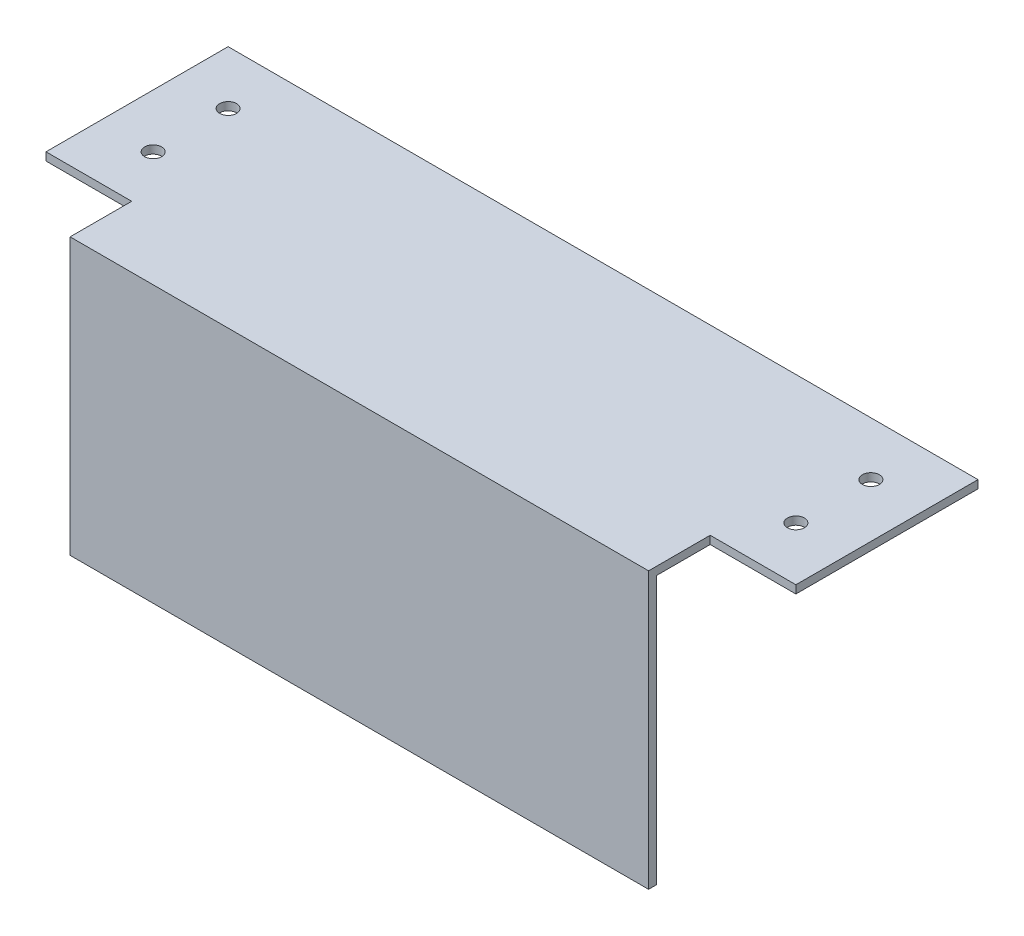
ISO-10303-21;
HEADER;
FILE_DESCRIPTION(('STEP AP214'),'2;1');
FILE_NAME('part.step','',(''),(''),'','','');
FILE_SCHEMA(('AUTOMOTIVE_DESIGN { 1 0 10303 214 1 1 1 1 }'));
ENDSEC;
DATA;
#1=APPLICATION_CONTEXT('core data for automotive mechanical design processes');
#2=APPLICATION_PROTOCOL_DEFINITION('international standard','automotive_design',2000,#1);
#3=PRODUCT_CONTEXT('',#1,'mechanical');
#4=PRODUCT('Part','Part','',(#3));
#5=PRODUCT_RELATED_PRODUCT_CATEGORY('part','',(#4));
#6=PRODUCT_DEFINITION_FORMATION('','',#4);
#7=PRODUCT_DEFINITION_CONTEXT('part definition',#1,'design');
#8=PRODUCT_DEFINITION('design','',#6,#7);
#9=PRODUCT_DEFINITION_SHAPE('','',#8);
#10=(LENGTH_UNIT() NAMED_UNIT(*) SI_UNIT(.MILLI.,.METRE.));
#11=(NAMED_UNIT(*) PLANE_ANGLE_UNIT() SI_UNIT($,.RADIAN.));
#12=(NAMED_UNIT(*) SI_UNIT($,.STERADIAN.) SOLID_ANGLE_UNIT());
#13=UNCERTAINTY_MEASURE_WITH_UNIT(LENGTH_MEASURE(1.E-05),#10,'distance_accuracy_value','');
#14=(GEOMETRIC_REPRESENTATION_CONTEXT(3) GLOBAL_UNCERTAINTY_ASSIGNED_CONTEXT((#13)) GLOBAL_UNIT_ASSIGNED_CONTEXT((#10,
#11,#12)) REPRESENTATION_CONTEXT('',''));
#15=CARTESIAN_POINT('',(0.,0.,0.));
#16=DIRECTION('',(0.,0.,1.));
#17=DIRECTION('',(1.,0.,0.));
#18=AXIS2_PLACEMENT_3D('',#15,#16,#17);
#19=CARTESIAN_POINT('',(0.,1.5,0.));
#20=DIRECTION('',(0.,-1.,0.));
#21=DIRECTION('',(0.,0.,-1.));
#22=AXIS2_PLACEMENT_3D('',#19,#20,#21);
#23=PLANE('',#22);
#24=DIRECTION('',(0.,0.,-1.));
#25=VECTOR('',#24,1.);
#26=CARTESIAN_POINT('',(84.4219002470459,1.5,-26.3714951285088));
#27=LINE('',#26,#25);
#28=CARTESIAN_POINT('',(84.4219002470459,1.5,-14.8714951285087));
#29=VERTEX_POINT('',#28);
#30=CARTESIAN_POINT('',(84.4219002470459,1.5,-26.3714951285088));
#31=VERTEX_POINT('',#30);
#32=EDGE_CURVE('E145',#29,#31,#27,.T.);
#33=ORIENTED_EDGE('',*,*,#32,.T.);
#34=DIRECTION('',(1.,0.,0.));
#35=VECTOR('',#34,1.);
#36=CARTESIAN_POINT('',(100.421900247046,1.5,-26.3714951285088));
#37=LINE('',#36,#35);
#38=CARTESIAN_POINT('',(100.421900247046,1.5,-26.3714951285088));
#39=VERTEX_POINT('',#38);
#40=EDGE_CURVE('E92',#31,#39,#37,.T.);
#41=ORIENTED_EDGE('',*,*,#40,.T.);
#42=DIRECTION('',(0.,0.,-1.));
#43=VECTOR('',#42,1.);
#44=CARTESIAN_POINT('',(100.421900247046,1.5,-60.371495128509));
#45=LINE('',#44,#43);
#46=CARTESIAN_POINT('',(100.421900247046,1.5,-60.371495128509));
#47=VERTEX_POINT('',#46);
#48=EDGE_CURVE('E161',#39,#47,#45,.T.);
#49=ORIENTED_EDGE('',*,*,#48,.T.);
#50=DIRECTION('',(-1.,0.,0.));
#51=VECTOR('',#50,1.);
#52=CARTESIAN_POINT('',(-39.578099752955,1.5,-60.371495128509));
#53=LINE('',#52,#51);
#54=CARTESIAN_POINT('',(-39.578099752955,1.5,-60.371495128509));
#55=VERTEX_POINT('',#54);
#56=EDGE_CURVE('E173',#47,#55,#53,.T.);
#57=ORIENTED_EDGE('',*,*,#56,.T.);
#58=DIRECTION('',(0.,0.,1.));
#59=VECTOR('',#58,1.);
#60=CARTESIAN_POINT('',(-39.578099752955,1.5,-26.3714951285087));
#61=LINE('',#60,#59);
#62=CARTESIAN_POINT('',(-39.578099752955,1.5,-26.3714951285087));
#63=VERTEX_POINT('',#62);
#64=EDGE_CURVE('E114',#55,#63,#61,.T.);
#65=ORIENTED_EDGE('',*,*,#64,.T.);
#66=DIRECTION('',(1.,0.,0.));
#67=VECTOR('',#66,1.);
#68=CARTESIAN_POINT('',(-39.578099752955,1.5,-26.3714951285087));
#69=LINE('',#68,#67);
#70=CARTESIAN_POINT('',(-23.578099752955,1.5,-26.3714951285087));
#71=VERTEX_POINT('',#70);
#72=EDGE_CURVE('E108',#63,#71,#69,.T.);
#73=ORIENTED_EDGE('',*,*,#72,.T.);
#74=DIRECTION('',(0.,0.,1.));
#75=VECTOR('',#74,1.);
#76=CARTESIAN_POINT('',(-23.578099752955,1.5,-26.3714951285087));
#77=LINE('',#76,#75);
#78=CARTESIAN_POINT('',(-23.578099752955,1.5,-14.8714951285087));
#79=VERTEX_POINT('',#78);
#80=EDGE_CURVE('E111',#71,#79,#77,.T.);
#81=ORIENTED_EDGE('',*,*,#80,.T.);
#82=DIRECTION('',(1.,0.,0.));
#83=VECTOR('',#82,1.);
#84=CARTESIAN_POINT('',(84.4219002470459,1.5,-14.8714951285087));
#85=LINE('',#84,#83);
#86=EDGE_CURVE('E56',#79,#29,#85,.T.);
#87=ORIENTED_EDGE('',*,*,#86,.T.);
#88=EDGE_LOOP('',(#33,#41,#49,#57,#65,#73,#81,#87));
#89=FACE_BOUND('',#88,.T.);
#90=CARTESIAN_POINT('',(90.4219002470459,1.5,-36.371495128509));
#91=DIRECTION('',(0.,1.,0.));
#92=DIRECTION('',(0.,0.,1.));
#93=AXIS2_PLACEMENT_3D('',#90,#91,#92);
#94=CIRCLE('',#93,1.5875);
#95=CARTESIAN_POINT('',(90.4219002470459,1.5,-34.783995128509));
#96=VERTEX_POINT('',#95);
#97=EDGE_CURVE('E134',#96,#96,#94,.T.);
#98=ORIENTED_EDGE('',*,*,#97,.F.);
#99=EDGE_LOOP('',(#98));
#100=FACE_BOUND('',#99,.T.);
#101=CARTESIAN_POINT('',(-29.578099752955,1.5,-36.371495128509));
#102=DIRECTION('',(0.,1.,0.));
#103=DIRECTION('',(0.,0.,1.));
#104=AXIS2_PLACEMENT_3D('',#101,#102,#103);
#105=CIRCLE('',#104,1.5875);
#106=CARTESIAN_POINT('',(-29.578099752955,1.5,-34.783995128509));
#107=VERTEX_POINT('',#106);
#108=EDGE_CURVE('E182',#107,#107,#105,.T.);
#109=ORIENTED_EDGE('',*,*,#108,.F.);
#110=EDGE_LOOP('',(#109));
#111=FACE_BOUND('',#110,.T.);
#112=CARTESIAN_POINT('',(90.4219002470459,1.5,-50.371495128509));
#113=DIRECTION('',(0.,1.,0.));
#114=DIRECTION('',(0.,0.,1.));
#115=AXIS2_PLACEMENT_3D('',#112,#113,#114);
#116=CIRCLE('',#115,1.5875);
#117=CARTESIAN_POINT('',(90.4219002470459,1.5,-48.783995128509));
#118=VERTEX_POINT('',#117);
#119=EDGE_CURVE('E188',#118,#118,#116,.T.);
#120=ORIENTED_EDGE('',*,*,#119,.F.);
#121=EDGE_LOOP('',(#120));
#122=FACE_BOUND('',#121,.T.);
#123=CARTESIAN_POINT('',(-29.578099752955,1.5,-50.371495128509));
#124=DIRECTION('',(0.,1.,0.));
#125=DIRECTION('',(0.,0.,1.));
#126=AXIS2_PLACEMENT_3D('',#123,#124,#125);
#127=CIRCLE('',#126,1.5875);
#128=CARTESIAN_POINT('',(-29.578099752955,1.5,-48.783995128509));
#129=VERTEX_POINT('',#128);
#130=EDGE_CURVE('E194',#129,#129,#127,.T.);
#131=ORIENTED_EDGE('',*,*,#130,.F.);
#132=EDGE_LOOP('',(#131));
#133=FACE_BOUND('',#132,.T.);
#134=ADVANCED_FACE('F32',(#89,#100,#111,#122,#133),#23,.F.);
#135=CARTESIAN_POINT('',(0.,0.,0.));
#136=DIRECTION('',(0.,-1.,0.));
#137=DIRECTION('',(0.,0.,-1.));
#138=AXIS2_PLACEMENT_3D('',#135,#136,#137);
#139=PLANE('',#138);
#140=DIRECTION('',(1.,0.,0.));
#141=VECTOR('',#140,1.);
#142=CARTESIAN_POINT('',(84.4219002470459,0.,-16.3714951285087));
#143=LINE('',#142,#141);
#144=CARTESIAN_POINT('',(-23.578099752955,0.,-16.3714951285087));
#145=VERTEX_POINT('',#144);
#146=CARTESIAN_POINT('',(84.4219002470459,0.,-16.3714951285087));
#147=VERTEX_POINT('',#146);
#148=EDGE_CURVE('E47',#145,#147,#143,.T.);
#149=ORIENTED_EDGE('',*,*,#148,.F.);
#150=DIRECTION('',(0.,0.,1.));
#151=VECTOR('',#150,1.);
#152=CARTESIAN_POINT('',(-23.578099752955,0.,-26.3714951285087));
#153=LINE('',#152,#151);
#154=CARTESIAN_POINT('',(-23.578099752955,0.,-26.3714951285087));
#155=VERTEX_POINT('',#154);
#156=EDGE_CURVE('E143',#155,#145,#153,.T.);
#157=ORIENTED_EDGE('',*,*,#156,.F.);
#158=DIRECTION('',(1.,0.,0.));
#159=VECTOR('',#158,1.);
#160=CARTESIAN_POINT('',(-39.578099752955,0.,-26.3714951285087));
#161=LINE('',#160,#159);
#162=CARTESIAN_POINT('',(-39.578099752955,0.,-26.3714951285087));
#163=VERTEX_POINT('',#162);
#164=EDGE_CURVE('E84',#163,#155,#161,.T.);
#165=ORIENTED_EDGE('',*,*,#164,.F.);
#166=DIRECTION('',(0.,0.,1.));
#167=VECTOR('',#166,1.);
#168=CARTESIAN_POINT('',(-39.578099752955,0.,-26.3714951285087));
#169=LINE('',#168,#167);
#170=CARTESIAN_POINT('',(-39.578099752955,0.,-60.371495128509));
#171=VERTEX_POINT('',#170);
#172=EDGE_CURVE('E140',#171,#163,#169,.T.);
#173=ORIENTED_EDGE('',*,*,#172,.F.);
#174=DIRECTION('',(-1.,0.,0.));
#175=VECTOR('',#174,1.);
#176=CARTESIAN_POINT('',(-39.578099752955,0.,-60.371495128509));
#177=LINE('',#176,#175);
#178=CARTESIAN_POINT('',(100.421900247046,0.,-60.371495128509));
#179=VERTEX_POINT('',#178);
#180=EDGE_CURVE('E138',#179,#171,#177,.T.);
#181=ORIENTED_EDGE('',*,*,#180,.F.);
#182=DIRECTION('',(0.,0.,-1.));
#183=VECTOR('',#182,1.);
#184=CARTESIAN_POINT('',(100.421900247046,0.,-60.371495128509));
#185=LINE('',#184,#183);
#186=CARTESIAN_POINT('',(100.421900247046,0.,-26.3714951285088));
#187=VERTEX_POINT('',#186);
#188=EDGE_CURVE('E136',#187,#179,#185,.T.);
#189=ORIENTED_EDGE('',*,*,#188,.F.);
#190=DIRECTION('',(1.,0.,0.));
#191=VECTOR('',#190,1.);
#192=CARTESIAN_POINT('',(100.421900247046,0.,-26.3714951285088));
#193=LINE('',#192,#191);
#194=CARTESIAN_POINT('',(84.4219002470459,0.,-26.3714951285088));
#195=VERTEX_POINT('',#194);
#196=EDGE_CURVE('E133',#195,#187,#193,.T.);
#197=ORIENTED_EDGE('',*,*,#196,.F.);
#198=DIRECTION('',(0.,0.,-1.));
#199=VECTOR('',#198,1.);
#200=CARTESIAN_POINT('',(84.4219002470459,0.,-26.3714951285088));
#201=LINE('',#200,#199);
#202=EDGE_CURVE('E131',#147,#195,#201,.T.);
#203=ORIENTED_EDGE('',*,*,#202,.F.);
#204=EDGE_LOOP('',(#149,#157,#165,#173,#181,#189,#197,#203));
#205=FACE_BOUND('',#204,.T.);
#206=CARTESIAN_POINT('',(90.4219002470459,0.,-50.371495128509));
#207=DIRECTION('',(0.,1.,0.));
#208=DIRECTION('',(0.,0.,1.));
#209=AXIS2_PLACEMENT_3D('',#206,#207,#208);
#210=CIRCLE('',#209,1.5875);
#211=CARTESIAN_POINT('',(90.4219002470459,0.,-48.783995128509));
#212=VERTEX_POINT('',#211);
#213=EDGE_CURVE('E191',#212,#212,#210,.T.);
#214=ORIENTED_EDGE('',*,*,#213,.T.);
#215=EDGE_LOOP('',(#214));
#216=FACE_BOUND('',#215,.T.);
#217=CARTESIAN_POINT('',(90.4219002470459,0.,-36.371495128509));
#218=DIRECTION('',(0.,1.,0.));
#219=DIRECTION('',(0.,0.,1.));
#220=AXIS2_PLACEMENT_3D('',#217,#218,#219);
#221=CIRCLE('',#220,1.5875);
#222=CARTESIAN_POINT('',(90.4219002470459,0.,-34.783995128509));
#223=VERTEX_POINT('',#222);
#224=EDGE_CURVE('E179',#223,#223,#221,.T.);
#225=ORIENTED_EDGE('',*,*,#224,.T.);
#226=EDGE_LOOP('',(#225));
#227=FACE_BOUND('',#226,.T.);
#228=CARTESIAN_POINT('',(-29.578099752955,0.,-36.371495128509));
#229=DIRECTION('',(0.,1.,0.));
#230=DIRECTION('',(0.,0.,1.));
#231=AXIS2_PLACEMENT_3D('',#228,#229,#230);
#232=CIRCLE('',#231,1.5875);
#233=CARTESIAN_POINT('',(-29.578099752955,0.,-34.783995128509));
#234=VERTEX_POINT('',#233);
#235=EDGE_CURVE('E185',#234,#234,#232,.T.);
#236=ORIENTED_EDGE('',*,*,#235,.T.);
#237=EDGE_LOOP('',(#236));
#238=FACE_BOUND('',#237,.T.);
#239=CARTESIAN_POINT('',(-29.578099752955,0.,-50.371495128509));
#240=DIRECTION('',(0.,1.,0.));
#241=DIRECTION('',(0.,0.,1.));
#242=AXIS2_PLACEMENT_3D('',#239,#240,#241);
#243=CIRCLE('',#242,1.5875);
#244=CARTESIAN_POINT('',(-29.578099752955,0.,-48.783995128509));
#245=VERTEX_POINT('',#244);
#246=EDGE_CURVE('E197',#245,#245,#243,.T.);
#247=ORIENTED_EDGE('',*,*,#246,.T.);
#248=EDGE_LOOP('',(#247));
#249=FACE_BOUND('',#248,.T.);
#250=ADVANCED_FACE('F164',(#205,#216,#227,#238,#249),#139,.T.);
#251=CARTESIAN_POINT('',(84.4219002470459,1.5,-26.3714951285088));
#252=DIRECTION('',(-1.,0.,0.));
#253=DIRECTION('',(0.,0.,1.));
#254=AXIS2_PLACEMENT_3D('',#251,#252,#253);
#255=PLANE('',#254);
#256=DIRECTION('',(0.,-1.,0.));
#257=VECTOR('',#256,1.);
#258=CARTESIAN_POINT('',(84.4219002470459,1.5,-14.8714951285087));
#259=LINE('',#258,#257);
#260=CARTESIAN_POINT('',(84.4219002470459,-50.,-14.8714951285087));
#261=VERTEX_POINT('',#260);
#262=EDGE_CURVE('E127',#29,#261,#259,.T.);
#263=ORIENTED_EDGE('',*,*,#262,.T.);
#264=DIRECTION('',(0.,0.,1.));
#265=VECTOR('',#264,1.);
#266=CARTESIAN_POINT('',(84.4219002470459,-50.,-14.8714951285087));
#267=LINE('',#266,#265);
#268=CARTESIAN_POINT('',(84.4219002470459,-50.,-16.3714951285087));
#269=VERTEX_POINT('',#268);
#270=EDGE_CURVE('E213',#269,#261,#267,.T.);
#271=ORIENTED_EDGE('',*,*,#270,.F.);
#272=DIRECTION('',(0.,1.,0.));
#273=VECTOR('',#272,1.);
#274=CARTESIAN_POINT('',(84.4219002470459,-50.,-16.3714951285087));
#275=LINE('',#274,#273);
#276=EDGE_CURVE('E205',#269,#147,#275,.T.);
#277=ORIENTED_EDGE('',*,*,#276,.T.);
#278=ORIENTED_EDGE('',*,*,#202,.T.);
#279=DIRECTION('',(0.,-1.,0.));
#280=VECTOR('',#279,1.);
#281=CARTESIAN_POINT('',(84.4219002470459,1.5,-26.3714951285088));
#282=LINE('',#281,#280);
#283=EDGE_CURVE('E11',#31,#195,#282,.T.);
#284=ORIENTED_EDGE('',*,*,#283,.F.);
#285=ORIENTED_EDGE('',*,*,#32,.F.);
#286=EDGE_LOOP('',(#263,#271,#277,#278,#284,#285));
#287=FACE_BOUND('',#286,.T.);
#288=ADVANCED_FACE('F34',(#287),#255,.F.);
#289=CARTESIAN_POINT('',(100.421900247046,1.5,-26.3714951285088));
#290=DIRECTION('',(0.,0.,-1.));
#291=DIRECTION('',(-1.,0.,0.));
#292=AXIS2_PLACEMENT_3D('',#289,#290,#291);
#293=PLANE('',#292);
#294=ORIENTED_EDGE('',*,*,#196,.T.);
#295=DIRECTION('',(0.,-1.,0.));
#296=VECTOR('',#295,1.);
#297=CARTESIAN_POINT('',(100.421900247046,1.5,-26.3714951285088));
#298=LINE('',#297,#296);
#299=EDGE_CURVE('E40',#39,#187,#298,.T.);
#300=ORIENTED_EDGE('',*,*,#299,.F.);
#301=ORIENTED_EDGE('',*,*,#40,.F.);
#302=ORIENTED_EDGE('',*,*,#283,.T.);
#303=EDGE_LOOP('',(#294,#300,#301,#302));
#304=FACE_BOUND('',#303,.T.);
#305=ADVANCED_FACE('F240',(#304),#293,.F.);
#306=CARTESIAN_POINT('',(100.421900247046,1.5,-60.371495128509));
#307=DIRECTION('',(-1.,0.,0.));
#308=DIRECTION('',(0.,0.,1.));
#309=AXIS2_PLACEMENT_3D('',#306,#307,#308);
#310=PLANE('',#309);
#311=ORIENTED_EDGE('',*,*,#188,.T.);
#312=DIRECTION('',(0.,-1.,0.));
#313=VECTOR('',#312,1.);
#314=CARTESIAN_POINT('',(100.421900247046,1.5,-60.371495128509));
#315=LINE('',#314,#313);
#316=EDGE_CURVE('E153',#47,#179,#315,.T.);
#317=ORIENTED_EDGE('',*,*,#316,.F.);
#318=ORIENTED_EDGE('',*,*,#48,.F.);
#319=ORIENTED_EDGE('',*,*,#299,.T.);
#320=EDGE_LOOP('',(#311,#317,#318,#319));
#321=FACE_BOUND('',#320,.T.);
#322=ADVANCED_FACE('F159',(#321),#310,.F.);
#323=CARTESIAN_POINT('',(-39.578099752955,1.5,-60.371495128509));
#324=DIRECTION('',(0.,0.,1.));
#325=DIRECTION('',(1.,0.,0.));
#326=AXIS2_PLACEMENT_3D('',#323,#324,#325);
#327=PLANE('',#326);
#328=ORIENTED_EDGE('',*,*,#180,.T.);
#329=DIRECTION('',(0.,-1.,0.));
#330=VECTOR('',#329,1.);
#331=CARTESIAN_POINT('',(-39.578099752955,1.5,-60.371495128509));
#332=LINE('',#331,#330);
#333=EDGE_CURVE('E150',#55,#171,#332,.T.);
#334=ORIENTED_EDGE('',*,*,#333,.F.);
#335=ORIENTED_EDGE('',*,*,#56,.F.);
#336=ORIENTED_EDGE('',*,*,#316,.T.);
#337=EDGE_LOOP('',(#328,#334,#335,#336));
#338=FACE_BOUND('',#337,.T.);
#339=ADVANCED_FACE('F169',(#338),#327,.F.);
#340=CARTESIAN_POINT('',(-39.578099752955,1.5,-26.3714951285087));
#341=DIRECTION('',(1.,0.,0.));
#342=DIRECTION('',(0.,0.,-1.));
#343=AXIS2_PLACEMENT_3D('',#340,#341,#342);
#344=PLANE('',#343);
#345=ORIENTED_EDGE('',*,*,#172,.T.);
#346=DIRECTION('',(0.,-1.,0.));
#347=VECTOR('',#346,1.);
#348=CARTESIAN_POINT('',(-39.578099752955,1.5,-26.3714951285087));
#349=LINE('',#348,#347);
#350=EDGE_CURVE('E120',#63,#163,#349,.T.);
#351=ORIENTED_EDGE('',*,*,#350,.F.);
#352=ORIENTED_EDGE('',*,*,#64,.F.);
#353=ORIENTED_EDGE('',*,*,#333,.T.);
#354=EDGE_LOOP('',(#345,#351,#352,#353));
#355=FACE_BOUND('',#354,.T.);
#356=ADVANCED_FACE('F172',(#355),#344,.F.);
#357=CARTESIAN_POINT('',(-39.578099752955,1.5,-26.3714951285087));
#358=DIRECTION('',(0.,0.,-1.));
#359=DIRECTION('',(-1.,0.,0.));
#360=AXIS2_PLACEMENT_3D('',#357,#358,#359);
#361=PLANE('',#360);
#362=ORIENTED_EDGE('',*,*,#164,.T.);
#363=DIRECTION('',(0.,-1.,0.));
#364=VECTOR('',#363,1.);
#365=CARTESIAN_POINT('',(-23.578099752955,1.5,-26.3714951285087));
#366=LINE('',#365,#364);
#367=EDGE_CURVE('E117',#71,#155,#366,.T.);
#368=ORIENTED_EDGE('',*,*,#367,.F.);
#369=ORIENTED_EDGE('',*,*,#72,.F.);
#370=ORIENTED_EDGE('',*,*,#350,.T.);
#371=EDGE_LOOP('',(#362,#368,#369,#370));
#372=FACE_BOUND('',#371,.T.);
#373=ADVANCED_FACE('F118',(#372),#361,.F.);
#374=CARTESIAN_POINT('',(-23.578099752955,1.5,-26.3714951285087));
#375=DIRECTION('',(1.,0.,0.));
#376=DIRECTION('',(0.,0.,-1.));
#377=AXIS2_PLACEMENT_3D('',#374,#375,#376);
#378=PLANE('',#377);
#379=ORIENTED_EDGE('',*,*,#156,.T.);
#380=DIRECTION('',(0.,1.,0.));
#381=VECTOR('',#380,1.);
#382=CARTESIAN_POINT('',(-23.578099752955,-50.,-16.3714951285087));
#383=LINE('',#382,#381);
#384=CARTESIAN_POINT('',(-23.578099752955,-50.,-16.3714951285087));
#385=VERTEX_POINT('',#384);
#386=EDGE_CURVE('E200',#385,#145,#383,.T.);
#387=ORIENTED_EDGE('',*,*,#386,.F.);
#388=DIRECTION('',(0.,0.,-1.));
#389=VECTOR('',#388,1.);
#390=CARTESIAN_POINT('',(-23.578099752955,-50.,-16.3714951285087));
#391=LINE('',#390,#389);
#392=CARTESIAN_POINT('',(-23.578099752955,-50.,-14.8714951285087));
#393=VERTEX_POINT('',#392);
#394=EDGE_CURVE('E210',#393,#385,#391,.T.);
#395=ORIENTED_EDGE('',*,*,#394,.F.);
#396=DIRECTION('',(0.,-1.,0.));
#397=VECTOR('',#396,1.);
#398=CARTESIAN_POINT('',(-23.578099752955,1.5,-14.8714951285087));
#399=LINE('',#398,#397);
#400=EDGE_CURVE('E121',#79,#393,#399,.T.);
#401=ORIENTED_EDGE('',*,*,#400,.F.);
#402=ORIENTED_EDGE('',*,*,#80,.F.);
#403=ORIENTED_EDGE('',*,*,#367,.T.);
#404=EDGE_LOOP('',(#379,#387,#395,#401,#402,#403));
#405=FACE_BOUND('',#404,.T.);
#406=ADVANCED_FACE('F123',(#405),#378,.F.);
#407=CARTESIAN_POINT('',(84.4219002470459,1.5,-14.8714951285087));
#408=DIRECTION('',(0.,0.,-1.));
#409=DIRECTION('',(-1.,0.,0.));
#410=AXIS2_PLACEMENT_3D('',#407,#408,#409);
#411=PLANE('',#410);
#412=ORIENTED_EDGE('',*,*,#400,.T.);
#413=DIRECTION('',(-1.,0.,0.));
#414=VECTOR('',#413,1.);
#415=CARTESIAN_POINT('',(-23.578099752955,-50.,-14.8714951285087));
#416=LINE('',#415,#414);
#417=EDGE_CURVE('E208',#261,#393,#416,.T.);
#418=ORIENTED_EDGE('',*,*,#417,.F.);
#419=ORIENTED_EDGE('',*,*,#262,.F.);
#420=ORIENTED_EDGE('',*,*,#86,.F.);
#421=EDGE_LOOP('',(#412,#418,#419,#420));
#422=FACE_BOUND('',#421,.T.);
#423=ADVANCED_FACE('F238',(#422),#411,.F.);
#424=CARTESIAN_POINT('',(90.4219002470459,1.5,-36.371495128509));
#425=DIRECTION('',(0.,-1.,0.));
#426=DIRECTION('',(0.,0.,-1.));
#427=AXIS2_PLACEMENT_3D('',#424,#425,#426);
#428=CYLINDRICAL_SURFACE('',#427,1.5875);
#429=ORIENTED_EDGE('',*,*,#97,.T.);
#430=EDGE_LOOP('',(#429));
#431=FACE_BOUND('',#430,.T.);
#432=ORIENTED_EDGE('',*,*,#224,.F.);
#433=EDGE_LOOP('',(#432));
#434=FACE_BOUND('',#433,.T.);
#435=ADVANCED_FACE('F254',(#431,#434),#428,.F.);
#436=CARTESIAN_POINT('',(-29.578099752955,1.5,-36.371495128509));
#437=DIRECTION('',(0.,-1.,0.));
#438=DIRECTION('',(0.,0.,-1.));
#439=AXIS2_PLACEMENT_3D('',#436,#437,#438);
#440=CYLINDRICAL_SURFACE('',#439,1.5875);
#441=ORIENTED_EDGE('',*,*,#108,.T.);
#442=EDGE_LOOP('',(#441));
#443=FACE_BOUND('',#442,.T.);
#444=ORIENTED_EDGE('',*,*,#235,.F.);
#445=EDGE_LOOP('',(#444));
#446=FACE_BOUND('',#445,.T.);
#447=ADVANCED_FACE('F294',(#443,#446),#440,.F.);
#448=CARTESIAN_POINT('',(90.4219002470459,1.5,-50.371495128509));
#449=DIRECTION('',(0.,-1.,0.));
#450=DIRECTION('',(0.,0.,-1.));
#451=AXIS2_PLACEMENT_3D('',#448,#449,#450);
#452=CYLINDRICAL_SURFACE('',#451,1.5875);
#453=ORIENTED_EDGE('',*,*,#119,.T.);
#454=EDGE_LOOP('',(#453));
#455=FACE_BOUND('',#454,.T.);
#456=ORIENTED_EDGE('',*,*,#213,.F.);
#457=EDGE_LOOP('',(#456));
#458=FACE_BOUND('',#457,.T.);
#459=ADVANCED_FACE('F301',(#455,#458),#452,.F.);
#460=CARTESIAN_POINT('',(-29.578099752955,1.5,-50.371495128509));
#461=DIRECTION('',(0.,-1.,0.));
#462=DIRECTION('',(0.,0.,-1.));
#463=AXIS2_PLACEMENT_3D('',#460,#461,#462);
#464=CYLINDRICAL_SURFACE('',#463,1.5875);
#465=ORIENTED_EDGE('',*,*,#130,.T.);
#466=EDGE_LOOP('',(#465));
#467=FACE_BOUND('',#466,.T.);
#468=ORIENTED_EDGE('',*,*,#246,.F.);
#469=EDGE_LOOP('',(#468));
#470=FACE_BOUND('',#469,.T.);
#471=ADVANCED_FACE('F308',(#467,#470),#464,.F.);
#472=CARTESIAN_POINT('',(84.4219002470459,-50.,-16.3714951285087));
#473=DIRECTION('',(0.,0.,1.));
#474=DIRECTION('',(1.,0.,0.));
#475=AXIS2_PLACEMENT_3D('',#472,#473,#474);
#476=PLANE('',#475);
#477=ORIENTED_EDGE('',*,*,#148,.T.);
#478=ORIENTED_EDGE('',*,*,#276,.F.);
#479=DIRECTION('',(1.,0.,0.));
#480=VECTOR('',#479,1.);
#481=CARTESIAN_POINT('',(84.4219002470459,-50.,-16.3714951285087));
#482=LINE('',#481,#480);
#483=EDGE_CURVE('E216',#385,#269,#482,.T.);
#484=ORIENTED_EDGE('',*,*,#483,.F.);
#485=ORIENTED_EDGE('',*,*,#386,.T.);
#486=EDGE_LOOP('',(#477,#478,#484,#485));
#487=FACE_BOUND('',#486,.T.);
#488=ADVANCED_FACE('F230',(#487),#476,.F.);
#489=CARTESIAN_POINT('',(0.,-50.,0.));
#490=DIRECTION('',(0.,1.,0.));
#491=DIRECTION('',(0.,0.,1.));
#492=AXIS2_PLACEMENT_3D('',#489,#490,#491);
#493=PLANE('',#492);
#494=ORIENTED_EDGE('',*,*,#394,.T.);
#495=ORIENTED_EDGE('',*,*,#483,.T.);
#496=ORIENTED_EDGE('',*,*,#270,.T.);
#497=ORIENTED_EDGE('',*,*,#417,.T.);
#498=EDGE_LOOP('',(#494,#495,#496,#497));
#499=FACE_BOUND('',#498,.T.);
#500=ADVANCED_FACE('F223',(#499),#493,.F.);
#501=CLOSED_SHELL('',(#134,#250,#288,#305,#322,#339,#356,#373,#406,#423,#435,#447,#459,#471,
#488,#500));
#502=MANIFOLD_SOLID_BREP('B2',#501);
#503=ADVANCED_BREP_SHAPE_REPRESENTATION('',(#18,#502),#14);
#504=SHAPE_DEFINITION_REPRESENTATION(#9,#503);
ENDSEC;
END-ISO-10303-21;
